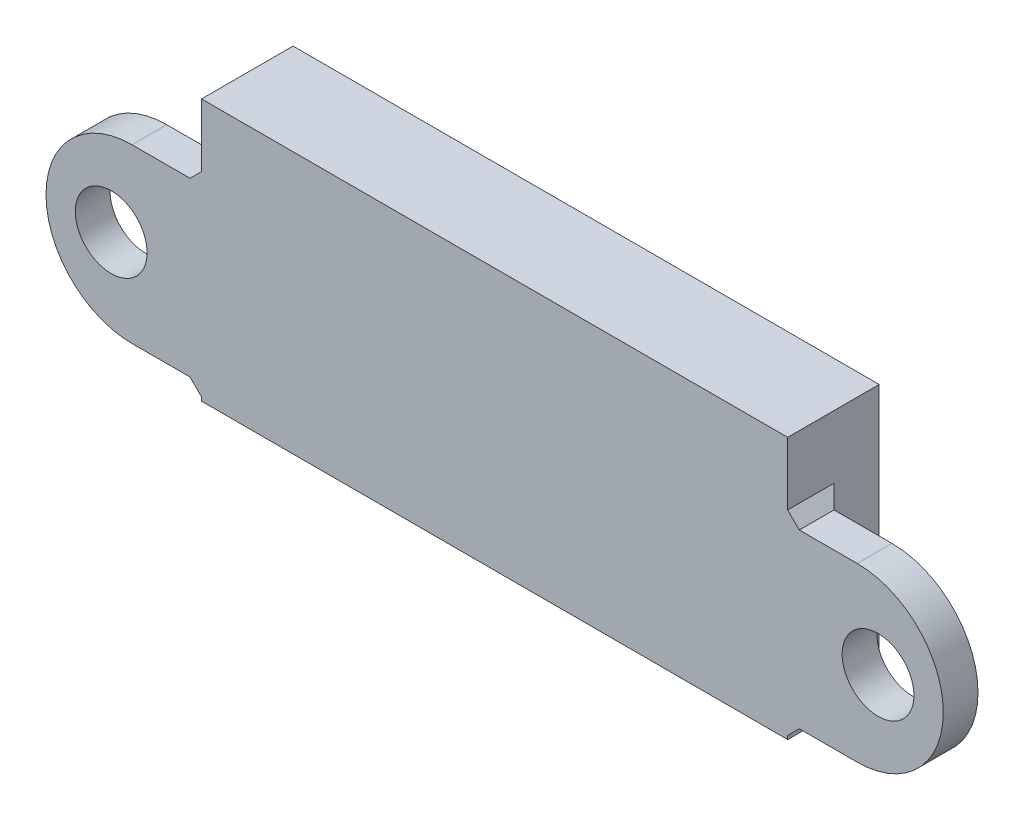
ISO-10303-21;
HEADER;
FILE_DESCRIPTION(('STEP AP214'),'2;1');
FILE_NAME('part.step','',(''),(''),'','','');
FILE_SCHEMA(('AUTOMOTIVE_DESIGN { 1 0 10303 214 1 1 1 1 }'));
ENDSEC;
DATA;
#1=APPLICATION_CONTEXT('core data for automotive mechanical design processes');
#2=APPLICATION_PROTOCOL_DEFINITION('international standard','automotive_design',2000,#1);
#3=PRODUCT_CONTEXT('',#1,'mechanical');
#4=PRODUCT('Part','Part','',(#3));
#5=PRODUCT_RELATED_PRODUCT_CATEGORY('part','',(#4));
#6=PRODUCT_DEFINITION_FORMATION('','',#4);
#7=PRODUCT_DEFINITION_CONTEXT('part definition',#1,'design');
#8=PRODUCT_DEFINITION('design','',#6,#7);
#9=PRODUCT_DEFINITION_SHAPE('','',#8);
#10=(LENGTH_UNIT() NAMED_UNIT(*) SI_UNIT(.MILLI.,.METRE.));
#11=(NAMED_UNIT(*) PLANE_ANGLE_UNIT() SI_UNIT($,.RADIAN.));
#12=(NAMED_UNIT(*) SI_UNIT($,.STERADIAN.) SOLID_ANGLE_UNIT());
#13=UNCERTAINTY_MEASURE_WITH_UNIT(LENGTH_MEASURE(1.E-05),#10,'distance_accuracy_value','');
#14=(GEOMETRIC_REPRESENTATION_CONTEXT(3) GLOBAL_UNCERTAINTY_ASSIGNED_CONTEXT((#13)) GLOBAL_UNIT_ASSIGNED_CONTEXT((#10,
#11,#12)) REPRESENTATION_CONTEXT('',''));
#15=CARTESIAN_POINT('',(0.,0.,0.));
#16=DIRECTION('',(0.,0.,1.));
#17=DIRECTION('',(1.,0.,0.));
#18=AXIS2_PLACEMENT_3D('',#15,#16,#17);
#19=CARTESIAN_POINT('',(0.,0.,5.));
#20=DIRECTION('',(0.,0.,1.));
#21=DIRECTION('',(1.,0.,0.));
#22=AXIS2_PLACEMENT_3D('',#19,#20,#21);
#23=PLANE('',#22);
#24=CARTESIAN_POINT('',(-33.1000000000001,-0.00956202959342609,5.));
#25=DIRECTION('',(0.,0.,-1.));
#26=DIRECTION('',(-1.,0.,0.));
#27=AXIS2_PLACEMENT_3D('',#24,#25,#26);
#28=CIRCLE('',#27,3.09999999999999);
#29=CARTESIAN_POINT('',(-36.2000000000001,-0.00956202959342609,5.));
#30=VERTEX_POINT('',#29);
#31=EDGE_CURVE('E342',#30,#30,#28,.T.);
#32=ORIENTED_EDGE('',*,*,#31,.T.);
#33=EDGE_LOOP('',(#32));
#34=FACE_BOUND('',#33,.T.);
#35=CARTESIAN_POINT('',(33.1000000000001,-0.00956202959342609,5.));
#36=DIRECTION('',(0.,0.,-1.));
#37=DIRECTION('',(1.,0.,0.));
#38=AXIS2_PLACEMENT_3D('',#35,#36,#37);
#39=CIRCLE('',#38,3.1);
#40=CARTESIAN_POINT('',(36.2000000000001,-0.00956202959342609,5.));
#41=VERTEX_POINT('',#40);
#42=EDGE_CURVE('E354',#41,#41,#39,.T.);
#43=ORIENTED_EDGE('',*,*,#42,.T.);
#44=EDGE_LOOP('',(#43));
#45=FACE_BOUND('',#44,.T.);
#46=DIRECTION('',(1.,0.,0.));
#47=VECTOR('',#46,1.);
#48=CARTESIAN_POINT('',(-25.3,-8.74999999999997,5.));
#49=LINE('',#48,#47);
#50=CARTESIAN_POINT('',(-25.3,-8.74999999999997,5.));
#51=VERTEX_POINT('',#50);
#52=CARTESIAN_POINT('',(25.3,-8.74999999999997,5.));
#53=VERTEX_POINT('',#52);
#54=EDGE_CURVE('E262',#51,#53,#49,.T.);
#55=ORIENTED_EDGE('',*,*,#54,.T.);
#56=DIRECTION('',(0.,1.,0.));
#57=VECTOR('',#56,1.);
#58=CARTESIAN_POINT('',(25.3,-8.74999999999997,5.));
#59=LINE('',#58,#57);
#60=CARTESIAN_POINT('',(25.3,-8.43955917908582,5.));
#61=VERTEX_POINT('',#60);
#62=EDGE_CURVE('E274',#53,#61,#59,.T.);
#63=ORIENTED_EDGE('',*,*,#62,.T.);
#64=DIRECTION('',(-0.707106781186543,-0.707106781186552,0.));
#65=VECTOR('',#64,1.);
#66=CARTESIAN_POINT('',(25.3,-8.43955917908582,5.));
#67=LINE('',#66,#65);
#68=CARTESIAN_POINT('',(26.3,-7.43955917908582,5.));
#69=VERTEX_POINT('',#68);
#70=EDGE_CURVE('E333',#61,#69,#67,.F.);
#71=ORIENTED_EDGE('',*,*,#70,.T.);
#72=DIRECTION('',(1.,0.,0.));
#73=VECTOR('',#72,1.);
#74=CARTESIAN_POINT('',(25.3,-7.43955917908582,5.));
#75=LINE('',#74,#73);
#76=CARTESIAN_POINT('',(31.3,-7.43955917908582,5.));
#77=VERTEX_POINT('',#76);
#78=EDGE_CURVE('E205',#69,#77,#75,.T.);
#79=ORIENTED_EDGE('',*,*,#78,.T.);
#80=CARTESIAN_POINT('',(31.3,-0.00956202959342609,5.));
#81=DIRECTION('',(0.,0.,1.));
#82=DIRECTION('',(1.,0.,0.));
#83=AXIS2_PLACEMENT_3D('',#80,#81,#82);
#84=CIRCLE('',#83,7.42999714949239);
#85=CARTESIAN_POINT('',(31.3,7.42043511989897,5.));
#86=VERTEX_POINT('',#85);
#87=EDGE_CURVE('E218',#77,#86,#84,.T.);
#88=ORIENTED_EDGE('',*,*,#87,.T.);
#89=DIRECTION('',(-1.,0.,0.));
#90=VECTOR('',#89,1.);
#91=CARTESIAN_POINT('',(31.3,7.42043511989897,5.));
#92=LINE('',#91,#90);
#93=CARTESIAN_POINT('',(26.3,7.42043511989897,5.));
#94=VERTEX_POINT('',#93);
#95=EDGE_CURVE('E210',#86,#94,#92,.T.);
#96=ORIENTED_EDGE('',*,*,#95,.T.);
#97=DIRECTION('',(0.707106781186542,-0.707106781186553,0.));
#98=VECTOR('',#97,1.);
#99=CARTESIAN_POINT('',(26.3,7.42043511989897,5.));
#100=LINE('',#99,#98);
#101=CARTESIAN_POINT('',(25.3,8.42043511989897,5.));
#102=VERTEX_POINT('',#101);
#103=EDGE_CURVE('E331',#94,#102,#100,.F.);
#104=ORIENTED_EDGE('',*,*,#103,.T.);
#105=CARTESIAN_POINT('',(25.3,13.85,5.));
#106=VERTEX_POINT('',#105);
#107=EDGE_CURVE('E273',#102,#106,#59,.T.);
#108=ORIENTED_EDGE('',*,*,#107,.T.);
#109=DIRECTION('',(-1.,0.,0.));
#110=VECTOR('',#109,1.);
#111=CARTESIAN_POINT('',(25.3,13.85,5.));
#112=LINE('',#111,#110);
#113=CARTESIAN_POINT('',(-25.3,13.85,5.));
#114=VERTEX_POINT('',#113);
#115=EDGE_CURVE('E277',#106,#114,#112,.T.);
#116=ORIENTED_EDGE('',*,*,#115,.T.);
#117=DIRECTION('',(0.,-1.,0.));
#118=VECTOR('',#117,1.);
#119=CARTESIAN_POINT('',(-25.3,13.85,5.));
#120=LINE('',#119,#118);
#121=CARTESIAN_POINT('',(-25.3,8.42043511989898,5.));
#122=VERTEX_POINT('',#121);
#123=EDGE_CURVE('E281',#114,#122,#120,.T.);
#124=ORIENTED_EDGE('',*,*,#123,.T.);
#125=DIRECTION('',(0.70710678118655,0.707106781186545,0.));
#126=VECTOR('',#125,1.);
#127=CARTESIAN_POINT('',(-25.3,8.42043511989898,5.));
#128=LINE('',#127,#126);
#129=CARTESIAN_POINT('',(-26.3,7.42043511989897,5.));
#130=VERTEX_POINT('',#129);
#131=EDGE_CURVE('E46',#122,#130,#128,.F.);
#132=ORIENTED_EDGE('',*,*,#131,.T.);
#133=DIRECTION('',(-1.,0.,0.));
#134=VECTOR('',#133,1.);
#135=CARTESIAN_POINT('',(-31.3000000000001,7.42043511989897,5.));
#136=LINE('',#135,#134);
#137=CARTESIAN_POINT('',(-31.3000000000001,7.42043511989897,5.));
#138=VERTEX_POINT('',#137);
#139=EDGE_CURVE('E193',#130,#138,#136,.T.);
#140=ORIENTED_EDGE('',*,*,#139,.T.);
#141=CARTESIAN_POINT('',(-31.3000000000001,-0.00956202959342609,5.));
#142=DIRECTION('',(0.,0.,1.));
#143=DIRECTION('',(-1.,0.,0.));
#144=AXIS2_PLACEMENT_3D('',#141,#142,#143);
#145=CIRCLE('',#144,7.42999714949239);
#146=CARTESIAN_POINT('',(-31.3,-7.43955917908582,5.));
#147=VERTEX_POINT('',#146);
#148=EDGE_CURVE('E201',#138,#147,#145,.T.);
#149=ORIENTED_EDGE('',*,*,#148,.T.);
#150=DIRECTION('',(1.,0.,0.));
#151=VECTOR('',#150,1.);
#152=CARTESIAN_POINT('',(-25.3,-7.43955917908582,5.));
#153=LINE('',#152,#151);
#154=CARTESIAN_POINT('',(-26.3,-7.43955917908582,5.));
#155=VERTEX_POINT('',#154);
#156=EDGE_CURVE('E178',#147,#155,#153,.T.);
#157=ORIENTED_EDGE('',*,*,#156,.T.);
#158=DIRECTION('',(-0.707106781186549,0.707106781186546,0.));
#159=VECTOR('',#158,1.);
#160=CARTESIAN_POINT('',(-26.3,-7.43955917908582,5.));
#161=LINE('',#160,#159);
#162=CARTESIAN_POINT('',(-25.3,-8.43955917908584,5.));
#163=VERTEX_POINT('',#162);
#164=EDGE_CURVE('E13',#155,#163,#161,.F.);
#165=ORIENTED_EDGE('',*,*,#164,.T.);
#166=EDGE_CURVE('E280',#163,#51,#120,.T.);
#167=ORIENTED_EDGE('',*,*,#166,.T.);
#168=EDGE_LOOP('',(#55,#63,#71,#79,#88,#96,#104,#108,#116,#124,#132,#140,#149,#157,#165,#167));
#169=FACE_BOUND('',#168,.T.);
#170=ADVANCED_FACE('F37',(#34,#45,#169),#23,.T.);
#171=CARTESIAN_POINT('',(24.,-7.44999999999997,-58.4176867074042));
#172=DIRECTION('',(1.,0.,0.));
#173=DIRECTION('',(0.,0.,-1.));
#174=AXIS2_PLACEMENT_3D('',#171,#172,#173);
#175=PLANE('',#174);
#176=DIRECTION('',(0.,0.,1.));
#177=VECTOR('',#176,1.);
#178=CARTESIAN_POINT('',(24.,-7.44999999999997,-58.4176867074042));
#179=LINE('',#178,#177);
#180=CARTESIAN_POINT('',(24.,-7.44999999999997,-2.9));
#181=VERTEX_POINT('',#180);
#182=CARTESIAN_POINT('',(24.,-7.44999999999997,0.));
#183=VERTEX_POINT('',#182);
#184=EDGE_CURVE('E235',#181,#183,#179,.T.);
#185=ORIENTED_EDGE('',*,*,#184,.T.);
#186=DIRECTION('',(0.,1.,0.));
#187=VECTOR('',#186,1.);
#188=CARTESIAN_POINT('',(24.,-7.44999999999997,0.));
#189=LINE('',#188,#187);
#190=CARTESIAN_POINT('',(24.,12.55,0.));
#191=VERTEX_POINT('',#190);
#192=EDGE_CURVE('E252',#183,#191,#189,.T.);
#193=ORIENTED_EDGE('',*,*,#192,.T.);
#194=DIRECTION('',(0.,0.,1.));
#195=VECTOR('',#194,1.);
#196=CARTESIAN_POINT('',(24.,12.55,-58.4176867074042));
#197=LINE('',#196,#195);
#198=CARTESIAN_POINT('',(24.,12.55,-2.9));
#199=VERTEX_POINT('',#198);
#200=EDGE_CURVE('E266',#199,#191,#197,.T.);
#201=ORIENTED_EDGE('',*,*,#200,.F.);
#202=DIRECTION('',(0.,-1.,0.));
#203=VECTOR('',#202,1.);
#204=CARTESIAN_POINT('',(24.,-7.44999999999997,-2.9));
#205=LINE('',#204,#203);
#206=EDGE_CURVE('E256',#199,#181,#205,.T.);
#207=ORIENTED_EDGE('',*,*,#206,.T.);
#208=EDGE_LOOP('',(#185,#193,#201,#207));
#209=FACE_BOUND('',#208,.T.);
#210=ADVANCED_FACE('F406',(#209),#175,.F.);
#211=CARTESIAN_POINT('',(24.,12.55,-58.4176867074042));
#212=DIRECTION('',(0.,1.,0.));
#213=DIRECTION('',(-1.,0.,0.));
#214=AXIS2_PLACEMENT_3D('',#211,#212,#213);
#215=PLANE('',#214);
#216=ORIENTED_EDGE('',*,*,#200,.T.);
#217=DIRECTION('',(-1.,0.,0.));
#218=VECTOR('',#217,1.);
#219=CARTESIAN_POINT('',(-6.08000000000001,12.55,0.));
#220=LINE('',#219,#218);
#221=CARTESIAN_POINT('',(-24.,12.55,0.));
#222=VERTEX_POINT('',#221);
#223=EDGE_CURVE('E298',#191,#222,#220,.T.);
#224=ORIENTED_EDGE('',*,*,#223,.T.);
#225=DIRECTION('',(0.,0.,1.));
#226=VECTOR('',#225,1.);
#227=CARTESIAN_POINT('',(-24.,12.55,-58.4176867074042));
#228=LINE('',#227,#226);
#229=CARTESIAN_POINT('',(-24.,12.55,-2.9));
#230=VERTEX_POINT('',#229);
#231=EDGE_CURVE('E263',#230,#222,#228,.T.);
#232=ORIENTED_EDGE('',*,*,#231,.F.);
#233=DIRECTION('',(1.,0.,0.));
#234=VECTOR('',#233,1.);
#235=CARTESIAN_POINT('',(24.,12.55,-2.9));
#236=LINE('',#235,#234);
#237=EDGE_CURVE('E240',#230,#199,#236,.T.);
#238=ORIENTED_EDGE('',*,*,#237,.T.);
#239=EDGE_LOOP('',(#216,#224,#232,#238));
#240=FACE_BOUND('',#239,.T.);
#241=ADVANCED_FACE('F411',(#240),#215,.F.);
#242=CARTESIAN_POINT('',(-24.,12.55,-58.4176867074042));
#243=DIRECTION('',(-1.,0.,0.));
#244=DIRECTION('',(0.,-1.,0.));
#245=AXIS2_PLACEMENT_3D('',#242,#243,#244);
#246=PLANE('',#245);
#247=ORIENTED_EDGE('',*,*,#231,.T.);
#248=DIRECTION('',(0.,-1.,0.));
#249=VECTOR('',#248,1.);
#250=CARTESIAN_POINT('',(-24.,12.55,0.));
#251=LINE('',#250,#249);
#252=CARTESIAN_POINT('',(-24.,-7.44999999999997,0.));
#253=VERTEX_POINT('',#252);
#254=EDGE_CURVE('E301',#222,#253,#251,.T.);
#255=ORIENTED_EDGE('',*,*,#254,.T.);
#256=DIRECTION('',(0.,0.,1.));
#257=VECTOR('',#256,1.);
#258=CARTESIAN_POINT('',(-24.,-7.44999999999997,-58.4176867074042));
#259=LINE('',#258,#257);
#260=CARTESIAN_POINT('',(-24.,-7.44999999999997,-2.9));
#261=VERTEX_POINT('',#260);
#262=EDGE_CURVE('E259',#261,#253,#259,.T.);
#263=ORIENTED_EDGE('',*,*,#262,.F.);
#264=DIRECTION('',(0.,1.,0.));
#265=VECTOR('',#264,1.);
#266=CARTESIAN_POINT('',(-24.,12.55,-2.9));
#267=LINE('',#266,#265);
#268=EDGE_CURVE('E244',#261,#230,#267,.T.);
#269=ORIENTED_EDGE('',*,*,#268,.T.);
#270=EDGE_LOOP('',(#247,#255,#263,#269));
#271=FACE_BOUND('',#270,.T.);
#272=ADVANCED_FACE('F500',(#271),#246,.F.);
#273=CARTESIAN_POINT('',(-24.,-7.44999999999997,-58.4176867074042));
#274=DIRECTION('',(0.,-1.,0.));
#275=DIRECTION('',(0.,0.,-1.));
#276=AXIS2_PLACEMENT_3D('',#273,#274,#275);
#277=PLANE('',#276);
#278=ORIENTED_EDGE('',*,*,#262,.T.);
#279=DIRECTION('',(1.,0.,0.));
#280=VECTOR('',#279,1.);
#281=CARTESIAN_POINT('',(-24.,-7.44999999999997,0.));
#282=LINE('',#281,#280);
#283=EDGE_CURVE('E304',#253,#183,#282,.T.);
#284=ORIENTED_EDGE('',*,*,#283,.T.);
#285=ORIENTED_EDGE('',*,*,#184,.F.);
#286=DIRECTION('',(-1.,0.,0.));
#287=VECTOR('',#286,1.);
#288=CARTESIAN_POINT('',(-24.,-7.44999999999997,-2.9));
#289=LINE('',#288,#287);
#290=EDGE_CURVE('E247',#181,#261,#289,.T.);
#291=ORIENTED_EDGE('',*,*,#290,.T.);
#292=EDGE_LOOP('',(#278,#284,#285,#291));
#293=FACE_BOUND('',#292,.T.);
#294=ADVANCED_FACE('F503',(#293),#277,.F.);
#295=CARTESIAN_POINT('',(25.3,-8.74999999999997,-58.4176867074042));
#296=DIRECTION('',(1.,0.,0.));
#297=DIRECTION('',(0.,0.,-1.));
#298=AXIS2_PLACEMENT_3D('',#295,#296,#297);
#299=PLANE('',#298);
#300=ORIENTED_EDGE('',*,*,#107,.F.);
#301=DIRECTION('',(0.,0.,-1.));
#302=VECTOR('',#301,1.);
#303=CARTESIAN_POINT('',(25.3,8.42043511989897,2.));
#304=LINE('',#303,#302);
#305=CARTESIAN_POINT('',(25.3,8.42043511989897,1.));
#306=VERTEX_POINT('',#305);
#307=EDGE_CURVE('E314',#102,#306,#304,.T.);
#308=ORIENTED_EDGE('',*,*,#307,.T.);
#309=DIRECTION('',(0.,-1.,0.));
#310=VECTOR('',#309,1.);
#311=CARTESIAN_POINT('',(25.3,-8.74999999999997,1.));
#312=LINE('',#311,#310);
#313=CARTESIAN_POINT('',(25.3,-8.43955917908582,1.));
#314=VERTEX_POINT('',#313);
#315=EDGE_CURVE('E312',#306,#314,#312,.T.);
#316=ORIENTED_EDGE('',*,*,#315,.T.);
#317=DIRECTION('',(0.,0.,1.));
#318=VECTOR('',#317,1.);
#319=CARTESIAN_POINT('',(25.3,-8.43955917908582,5.));
#320=LINE('',#319,#318);
#321=EDGE_CURVE('E310',#314,#61,#320,.T.);
#322=ORIENTED_EDGE('',*,*,#321,.T.);
#323=ORIENTED_EDGE('',*,*,#62,.F.);
#324=DIRECTION('',(0.,0.,1.));
#325=VECTOR('',#324,1.);
#326=CARTESIAN_POINT('',(25.3,-8.74999999999997,-58.4176867074042));
#327=LINE('',#326,#325);
#328=CARTESIAN_POINT('',(25.3,-8.74999999999997,-2.9));
#329=VERTEX_POINT('',#328);
#330=EDGE_CURVE('E284',#329,#53,#327,.T.);
#331=ORIENTED_EDGE('',*,*,#330,.F.);
#332=DIRECTION('',(0.,-1.,0.));
#333=VECTOR('',#332,1.);
#334=CARTESIAN_POINT('',(25.3,-8.74999999999997,-2.9));
#335=LINE('',#334,#333);
#336=CARTESIAN_POINT('',(25.3,13.85,-2.9));
#337=VERTEX_POINT('',#336);
#338=EDGE_CURVE('E243',#337,#329,#335,.T.);
#339=ORIENTED_EDGE('',*,*,#338,.F.);
#340=DIRECTION('',(0.,0.,1.));
#341=VECTOR('',#340,1.);
#342=CARTESIAN_POINT('',(25.3,13.85,-58.4176867074042));
#343=LINE('',#342,#341);
#344=EDGE_CURVE('E290',#337,#106,#343,.T.);
#345=ORIENTED_EDGE('',*,*,#344,.T.);
#346=EDGE_LOOP('',(#300,#308,#316,#322,#323,#331,#339,#345));
#347=FACE_BOUND('',#346,.T.);
#348=ADVANCED_FACE('F456',(#347),#299,.T.);
#349=CARTESIAN_POINT('',(25.3,13.85,-58.4176867074042));
#350=DIRECTION('',(0.,1.,0.));
#351=DIRECTION('',(0.,0.,1.));
#352=AXIS2_PLACEMENT_3D('',#349,#350,#351);
#353=PLANE('',#352);
#354=DIRECTION('',(1.,0.,0.));
#355=VECTOR('',#354,1.);
#356=CARTESIAN_POINT('',(25.3,13.85,-2.9));
#357=LINE('',#356,#355);
#358=CARTESIAN_POINT('',(-25.3,13.85,-2.9));
#359=VERTEX_POINT('',#358);
#360=EDGE_CURVE('E253',#359,#337,#357,.T.);
#361=ORIENTED_EDGE('',*,*,#360,.F.);
#362=DIRECTION('',(0.,0.,1.));
#363=VECTOR('',#362,1.);
#364=CARTESIAN_POINT('',(-25.3,13.85,-58.4176867074042));
#365=LINE('',#364,#363);
#366=EDGE_CURVE('E288',#359,#114,#365,.T.);
#367=ORIENTED_EDGE('',*,*,#366,.T.);
#368=ORIENTED_EDGE('',*,*,#115,.F.);
#369=ORIENTED_EDGE('',*,*,#344,.F.);
#370=EDGE_LOOP('',(#361,#367,#368,#369));
#371=FACE_BOUND('',#370,.T.);
#372=ADVANCED_FACE('F513',(#371),#353,.T.);
#373=CARTESIAN_POINT('',(-25.3,13.85,-58.4176867074042));
#374=DIRECTION('',(-1.,0.,0.));
#375=DIRECTION('',(0.,0.,1.));
#376=AXIS2_PLACEMENT_3D('',#373,#374,#375);
#377=PLANE('',#376);
#378=DIRECTION('',(0.,1.,0.));
#379=VECTOR('',#378,1.);
#380=CARTESIAN_POINT('',(-25.3,7.42043511989897,0.999999999999987));
#381=LINE('',#380,#379);
#382=CARTESIAN_POINT('',(-25.3,-8.43955917908584,0.999999999999987));
#383=VERTEX_POINT('',#382);
#384=CARTESIAN_POINT('',(-25.3,8.42043511989898,0.999999999999987));
#385=VERTEX_POINT('',#384);
#386=EDGE_CURVE('E322',#383,#385,#381,.T.);
#387=ORIENTED_EDGE('',*,*,#386,.T.);
#388=DIRECTION('',(0.,0.,1.));
#389=VECTOR('',#388,1.);
#390=CARTESIAN_POINT('',(-25.3,8.42043511989898,5.));
#391=LINE('',#390,#389);
#392=EDGE_CURVE('E324',#385,#122,#391,.T.);
#393=ORIENTED_EDGE('',*,*,#392,.T.);
#394=ORIENTED_EDGE('',*,*,#123,.F.);
#395=ORIENTED_EDGE('',*,*,#366,.F.);
#396=DIRECTION('',(0.,1.,0.));
#397=VECTOR('',#396,1.);
#398=CARTESIAN_POINT('',(-25.3,13.85,-2.9));
#399=LINE('',#398,#397);
#400=CARTESIAN_POINT('',(-25.3,-8.74999999999997,-2.9));
#401=VERTEX_POINT('',#400);
#402=EDGE_CURVE('E255',#401,#359,#399,.T.);
#403=ORIENTED_EDGE('',*,*,#402,.F.);
#404=DIRECTION('',(0.,0.,1.));
#405=VECTOR('',#404,1.);
#406=CARTESIAN_POINT('',(-25.3,-8.74999999999997,-58.4176867074042));
#407=LINE('',#406,#405);
#408=EDGE_CURVE('E285',#401,#51,#407,.T.);
#409=ORIENTED_EDGE('',*,*,#408,.T.);
#410=ORIENTED_EDGE('',*,*,#166,.F.);
#411=DIRECTION('',(0.,0.,-1.));
#412=VECTOR('',#411,1.);
#413=CARTESIAN_POINT('',(-25.3,-8.43955917908584,2.));
#414=LINE('',#413,#412);
#415=EDGE_CURVE('E320',#163,#383,#414,.T.);
#416=ORIENTED_EDGE('',*,*,#415,.T.);
#417=EDGE_LOOP('',(#387,#393,#394,#395,#403,#409,#410,#416));
#418=FACE_BOUND('',#417,.T.);
#419=ADVANCED_FACE('F446',(#418),#377,.T.);
#420=CARTESIAN_POINT('',(-25.3,-8.74999999999997,-58.4176867074042));
#421=DIRECTION('',(0.,-1.,0.));
#422=DIRECTION('',(0.,0.,-1.));
#423=AXIS2_PLACEMENT_3D('',#420,#421,#422);
#424=PLANE('',#423);
#425=DIRECTION('',(-1.,0.,0.));
#426=VECTOR('',#425,1.);
#427=CARTESIAN_POINT('',(-25.3,-8.74999999999997,-2.9));
#428=LINE('',#427,#426);
#429=EDGE_CURVE('E250',#329,#401,#428,.T.);
#430=ORIENTED_EDGE('',*,*,#429,.F.);
#431=ORIENTED_EDGE('',*,*,#330,.T.);
#432=ORIENTED_EDGE('',*,*,#54,.F.);
#433=ORIENTED_EDGE('',*,*,#408,.F.);
#434=EDGE_LOOP('',(#430,#431,#432,#433));
#435=FACE_BOUND('',#434,.T.);
#436=ADVANCED_FACE('F416',(#435),#424,.T.);
#437=CARTESIAN_POINT('',(0.,5.5,-2.9));
#438=DIRECTION('',(0.,0.,1.));
#439=DIRECTION('',(0.,1.,0.));
#440=AXIS2_PLACEMENT_3D('',#437,#438,#439);
#441=PLANE('',#440);
#442=ORIENTED_EDGE('',*,*,#429,.T.);
#443=ORIENTED_EDGE('',*,*,#402,.T.);
#444=ORIENTED_EDGE('',*,*,#360,.T.);
#445=ORIENTED_EDGE('',*,*,#338,.T.);
#446=EDGE_LOOP('',(#442,#443,#444,#445));
#447=FACE_BOUND('',#446,.T.);
#448=ORIENTED_EDGE('',*,*,#206,.F.);
#449=ORIENTED_EDGE('',*,*,#237,.F.);
#450=ORIENTED_EDGE('',*,*,#268,.F.);
#451=ORIENTED_EDGE('',*,*,#290,.F.);
#452=EDGE_LOOP('',(#448,#449,#450,#451));
#453=FACE_BOUND('',#452,.T.);
#454=ADVANCED_FACE('F422',(#447,#453),#441,.F.);
#455=CARTESIAN_POINT('',(0.,0.,0.));
#456=DIRECTION('',(0.,0.,1.));
#457=DIRECTION('',(1.,0.,0.));
#458=AXIS2_PLACEMENT_3D('',#455,#456,#457);
#459=PLANE('',#458);
#460=CARTESIAN_POINT('',(18.5,0.,0.));
#461=DIRECTION('',(0.,0.,-1.));
#462=DIRECTION('',(-1.,0.,0.));
#463=AXIS2_PLACEMENT_3D('',#460,#461,#462);
#464=CIRCLE('',#463,1.1);
#465=CARTESIAN_POINT('',(17.4,0.,0.));
#466=VERTEX_POINT('',#465);
#467=EDGE_CURVE('E228',#466,#466,#464,.T.);
#468=ORIENTED_EDGE('',*,*,#467,.F.);
#469=EDGE_LOOP('',(#468));
#470=FACE_BOUND('',#469,.T.);
#471=CARTESIAN_POINT('',(-18.5,0.,0.));
#472=DIRECTION('',(0.,0.,-1.));
#473=DIRECTION('',(-1.,0.,0.));
#474=AXIS2_PLACEMENT_3D('',#471,#472,#473);
#475=CIRCLE('',#474,1.1);
#476=CARTESIAN_POINT('',(-19.6,0.,0.));
#477=VERTEX_POINT('',#476);
#478=EDGE_CURVE('E225',#477,#477,#475,.T.);
#479=ORIENTED_EDGE('',*,*,#478,.F.);
#480=EDGE_LOOP('',(#479));
#481=FACE_BOUND('',#480,.T.);
#482=ORIENTED_EDGE('',*,*,#192,.F.);
#483=ORIENTED_EDGE('',*,*,#283,.F.);
#484=ORIENTED_EDGE('',*,*,#254,.F.);
#485=ORIENTED_EDGE('',*,*,#223,.F.);
#486=EDGE_LOOP('',(#482,#483,#484,#485));
#487=FACE_BOUND('',#486,.T.);
#488=ADVANCED_FACE('F418',(#470,#481,#487),#459,.F.);
#489=CARTESIAN_POINT('',(0.,0.,3.));
#490=DIRECTION('',(0.,0.,1.));
#491=DIRECTION('',(1.,0.,0.));
#492=AXIS2_PLACEMENT_3D('',#489,#490,#491);
#493=PLANE('',#492);
#494=CARTESIAN_POINT('',(-18.5,0.,3.));
#495=DIRECTION('',(0.,0.,1.));
#496=DIRECTION('',(1.,0.,0.));
#497=AXIS2_PLACEMENT_3D('',#494,#495,#496);
#498=CIRCLE('',#497,1.1);
#499=CARTESIAN_POINT('',(-17.4,0.,3.));
#500=VERTEX_POINT('',#499);
#501=EDGE_CURVE('E232',#500,#500,#498,.F.);
#502=ORIENTED_EDGE('',*,*,#501,.T.);
#503=EDGE_LOOP('',(#502));
#504=FACE_BOUND('',#503,.T.);
#505=ADVANCED_FACE('F421',(#504),#493,.F.);
#506=CARTESIAN_POINT('',(-18.5,0.,8.11126983722081));
#507=DIRECTION('',(0.,0.,-1.));
#508=DIRECTION('',(-1.,0.,0.));
#509=AXIS2_PLACEMENT_3D('',#506,#507,#508);
#510=CYLINDRICAL_SURFACE('',#509,1.1);
#511=ORIENTED_EDGE('',*,*,#478,.T.);
#512=EDGE_LOOP('',(#511));
#513=FACE_BOUND('',#512,.T.);
#514=ORIENTED_EDGE('',*,*,#501,.F.);
#515=EDGE_LOOP('',(#514));
#516=FACE_BOUND('',#515,.T.);
#517=ADVANCED_FACE('F486',(#513,#516),#510,.F.);
#518=CARTESIAN_POINT('',(0.,0.,3.));
#519=DIRECTION('',(0.,0.,1.));
#520=DIRECTION('',(1.,0.,0.));
#521=AXIS2_PLACEMENT_3D('',#518,#519,#520);
#522=PLANE('',#521);
#523=CARTESIAN_POINT('',(18.5,0.,3.));
#524=DIRECTION('',(0.,0.,1.));
#525=DIRECTION('',(1.,0.,0.));
#526=AXIS2_PLACEMENT_3D('',#523,#524,#525);
#527=CIRCLE('',#526,1.1);
#528=CARTESIAN_POINT('',(19.6,0.,3.));
#529=VERTEX_POINT('',#528);
#530=EDGE_CURVE('E231',#529,#529,#527,.F.);
#531=ORIENTED_EDGE('',*,*,#530,.T.);
#532=EDGE_LOOP('',(#531));
#533=FACE_BOUND('',#532,.T.);
#534=ADVANCED_FACE('F481',(#533),#522,.F.);
#535=CARTESIAN_POINT('',(18.5,0.,8.11126983722081));
#536=DIRECTION('',(0.,0.,-1.));
#537=DIRECTION('',(-1.,0.,0.));
#538=AXIS2_PLACEMENT_3D('',#535,#536,#537);
#539=CYLINDRICAL_SURFACE('',#538,1.1);
#540=ORIENTED_EDGE('',*,*,#467,.T.);
#541=EDGE_LOOP('',(#540));
#542=FACE_BOUND('',#541,.T.);
#543=ORIENTED_EDGE('',*,*,#530,.F.);
#544=EDGE_LOOP('',(#543));
#545=FACE_BOUND('',#544,.T.);
#546=ADVANCED_FACE('F477',(#542,#545),#539,.F.);
#547=CARTESIAN_POINT('',(31.3,7.42043511989897,2.));
#548=DIRECTION('',(0.,1.,0.));
#549=DIRECTION('',(-1.,0.,0.));
#550=AXIS2_PLACEMENT_3D('',#547,#548,#549);
#551=PLANE('',#550);
#552=DIRECTION('',(-1.,0.,0.));
#553=VECTOR('',#552,1.);
#554=CARTESIAN_POINT('',(31.3,7.42043511989897,2.));
#555=LINE('',#554,#553);
#556=CARTESIAN_POINT('',(31.3,7.42043511989897,2.));
#557=VERTEX_POINT('',#556);
#558=CARTESIAN_POINT('',(26.3,7.42043511989897,2.));
#559=VERTEX_POINT('',#558);
#560=EDGE_CURVE('E213',#557,#559,#555,.T.);
#561=ORIENTED_EDGE('',*,*,#560,.T.);
#562=DIRECTION('',(0.,0.,1.));
#563=VECTOR('',#562,1.);
#564=CARTESIAN_POINT('',(26.3,7.42043511989897,5.));
#565=LINE('',#564,#563);
#566=EDGE_CURVE('E307',#559,#94,#565,.T.);
#567=ORIENTED_EDGE('',*,*,#566,.T.);
#568=ORIENTED_EDGE('',*,*,#95,.F.);
#569=DIRECTION('',(0.,0.,1.));
#570=VECTOR('',#569,1.);
#571=CARTESIAN_POINT('',(31.3,7.42043511989897,2.));
#572=LINE('',#571,#570);
#573=EDGE_CURVE('E223',#557,#86,#572,.T.);
#574=ORIENTED_EDGE('',*,*,#573,.F.);
#575=EDGE_LOOP('',(#561,#567,#568,#574));
#576=FACE_BOUND('',#575,.T.);
#577=ADVANCED_FACE('F391',(#576),#551,.T.);
#578=CARTESIAN_POINT('',(31.3,-0.00956202959342609,2.));
#579=DIRECTION('',(0.,0.,1.));
#580=DIRECTION('',(1.,0.,0.));
#581=AXIS2_PLACEMENT_3D('',#578,#579,#580);
#582=CYLINDRICAL_SURFACE('',#581,7.42999714949239);
#583=ORIENTED_EDGE('',*,*,#87,.F.);
#584=DIRECTION('',(0.,0.,1.));
#585=VECTOR('',#584,1.);
#586=CARTESIAN_POINT('',(31.3,-7.43955917908582,2.));
#587=LINE('',#586,#585);
#588=CARTESIAN_POINT('',(31.3,-7.43955917908582,2.));
#589=VERTEX_POINT('',#588);
#590=EDGE_CURVE('E216',#589,#77,#587,.T.);
#591=ORIENTED_EDGE('',*,*,#590,.F.);
#592=CARTESIAN_POINT('',(31.3,-0.00956202959342609,2.));
#593=DIRECTION('',(0.,0.,1.));
#594=DIRECTION('',(1.,0.,0.));
#595=AXIS2_PLACEMENT_3D('',#592,#593,#594);
#596=CIRCLE('',#595,7.42999714949239);
#597=EDGE_CURVE('E209',#589,#557,#596,.T.);
#598=ORIENTED_EDGE('',*,*,#597,.T.);
#599=ORIENTED_EDGE('',*,*,#573,.T.);
#600=EDGE_LOOP('',(#583,#591,#598,#599));
#601=FACE_BOUND('',#600,.T.);
#602=ADVANCED_FACE('F397',(#601),#582,.T.);
#603=CARTESIAN_POINT('',(25.3,-7.43955917908582,2.));
#604=DIRECTION('',(0.,-1.,0.));
#605=DIRECTION('',(1.,0.,0.));
#606=AXIS2_PLACEMENT_3D('',#603,#604,#605);
#607=PLANE('',#606);
#608=ORIENTED_EDGE('',*,*,#78,.F.);
#609=DIRECTION('',(0.,0.,-1.));
#610=VECTOR('',#609,1.);
#611=CARTESIAN_POINT('',(26.3,-7.43955917908582,2.));
#612=LINE('',#611,#610);
#613=CARTESIAN_POINT('',(26.3,-7.43955917908582,2.));
#614=VERTEX_POINT('',#613);
#615=EDGE_CURVE('E318',#69,#614,#612,.T.);
#616=ORIENTED_EDGE('',*,*,#615,.T.);
#617=DIRECTION('',(1.,0.,0.));
#618=VECTOR('',#617,1.);
#619=CARTESIAN_POINT('',(25.3,-7.43955917908582,2.));
#620=LINE('',#619,#618);
#621=EDGE_CURVE('E207',#614,#589,#620,.T.);
#622=ORIENTED_EDGE('',*,*,#621,.T.);
#623=ORIENTED_EDGE('',*,*,#590,.T.);
#624=EDGE_LOOP('',(#608,#616,#622,#623));
#625=FACE_BOUND('',#624,.T.);
#626=ADVANCED_FACE('F367',(#625),#607,.T.);
#627=CARTESIAN_POINT('',(31.3,-0.00956202959342609,2.));
#628=DIRECTION('',(0.,0.,1.));
#629=DIRECTION('',(1.,0.,0.));
#630=AXIS2_PLACEMENT_3D('',#627,#628,#629);
#631=PLANE('',#630);
#632=CARTESIAN_POINT('',(33.1000000000001,-0.00956202959342609,2.));
#633=DIRECTION('',(0.,0.,-1.));
#634=DIRECTION('',(1.,0.,0.));
#635=AXIS2_PLACEMENT_3D('',#632,#633,#634);
#636=CIRCLE('',#635,3.1);
#637=CARTESIAN_POINT('',(36.2000000000001,-0.00956202959342609,2.));
#638=VERTEX_POINT('',#637);
#639=EDGE_CURVE('E197',#638,#638,#636,.T.);
#640=ORIENTED_EDGE('',*,*,#639,.F.);
#641=EDGE_LOOP('',(#640));
#642=FACE_BOUND('',#641,.T.);
#643=ORIENTED_EDGE('',*,*,#621,.F.);
#644=DIRECTION('',(0.,1.,0.));
#645=VECTOR('',#644,1.);
#646=CARTESIAN_POINT('',(26.3,-0.00956202959342609,2.));
#647=LINE('',#646,#645);
#648=EDGE_CURVE('E316',#614,#559,#647,.T.);
#649=ORIENTED_EDGE('',*,*,#648,.T.);
#650=ORIENTED_EDGE('',*,*,#560,.F.);
#651=ORIENTED_EDGE('',*,*,#597,.F.);
#652=EDGE_LOOP('',(#643,#649,#650,#651));
#653=FACE_BOUND('',#652,.T.);
#654=ADVANCED_FACE('F364',(#642,#653),#631,.F.);
#655=CARTESIAN_POINT('',(-31.3000000000001,-0.00956202959342609,2.));
#656=DIRECTION('',(0.,0.,1.));
#657=DIRECTION('',(1.,0.,0.));
#658=AXIS2_PLACEMENT_3D('',#655,#656,#657);
#659=CYLINDRICAL_SURFACE('',#658,7.42999714949239);
#660=ORIENTED_EDGE('',*,*,#148,.F.);
#661=DIRECTION('',(0.,0.,1.));
#662=VECTOR('',#661,1.);
#663=CARTESIAN_POINT('',(-31.3000000000001,7.42043511989897,2.));
#664=LINE('',#663,#662);
#665=CARTESIAN_POINT('',(-31.3000000000001,7.42043511989897,2.));
#666=VERTEX_POINT('',#665);
#667=EDGE_CURVE('E183',#666,#138,#664,.T.);
#668=ORIENTED_EDGE('',*,*,#667,.F.);
#669=CARTESIAN_POINT('',(-31.3000000000001,-0.00956202959342609,2.));
#670=DIRECTION('',(0.,0.,1.));
#671=DIRECTION('',(-1.,0.,0.));
#672=AXIS2_PLACEMENT_3D('',#669,#670,#671);
#673=CIRCLE('',#672,7.42999714949239);
#674=CARTESIAN_POINT('',(-31.3,-7.43955917908582,2.));
#675=VERTEX_POINT('',#674);
#676=EDGE_CURVE('E188',#666,#675,#673,.T.);
#677=ORIENTED_EDGE('',*,*,#676,.T.);
#678=DIRECTION('',(0.,0.,1.));
#679=VECTOR('',#678,1.);
#680=CARTESIAN_POINT('',(-31.3,-7.43955917908582,2.));
#681=LINE('',#680,#679);
#682=EDGE_CURVE('E175',#675,#147,#681,.T.);
#683=ORIENTED_EDGE('',*,*,#682,.T.);
#684=EDGE_LOOP('',(#660,#668,#677,#683));
#685=FACE_BOUND('',#684,.T.);
#686=ADVANCED_FACE('F191',(#685),#659,.T.);
#687=CARTESIAN_POINT('',(-31.3000000000001,7.42043511989897,2.));
#688=DIRECTION('',(0.,1.,0.));
#689=DIRECTION('',(-1.,0.,0.));
#690=AXIS2_PLACEMENT_3D('',#687,#688,#689);
#691=PLANE('',#690);
#692=ORIENTED_EDGE('',*,*,#139,.F.);
#693=DIRECTION('',(0.,0.,-1.));
#694=VECTOR('',#693,1.);
#695=CARTESIAN_POINT('',(-26.3,7.42043511989897,2.));
#696=LINE('',#695,#694);
#697=CARTESIAN_POINT('',(-26.3,7.42043511989897,2.));
#698=VERTEX_POINT('',#697);
#699=EDGE_CURVE('E327',#130,#698,#696,.T.);
#700=ORIENTED_EDGE('',*,*,#699,.T.);
#701=DIRECTION('',(-1.,0.,0.));
#702=VECTOR('',#701,1.);
#703=CARTESIAN_POINT('',(-31.3000000000001,7.42043511989897,2.));
#704=LINE('',#703,#702);
#705=EDGE_CURVE('E184',#698,#666,#704,.T.);
#706=ORIENTED_EDGE('',*,*,#705,.T.);
#707=ORIENTED_EDGE('',*,*,#667,.T.);
#708=EDGE_LOOP('',(#692,#700,#706,#707));
#709=FACE_BOUND('',#708,.T.);
#710=ADVANCED_FACE('F464',(#709),#691,.T.);
#711=CARTESIAN_POINT('',(-25.3,-7.43955917908582,2.));
#712=DIRECTION('',(0.,-1.,0.));
#713=DIRECTION('',(1.,0.,0.));
#714=AXIS2_PLACEMENT_3D('',#711,#712,#713);
#715=PLANE('',#714);
#716=DIRECTION('',(1.,0.,0.));
#717=VECTOR('',#716,1.);
#718=CARTESIAN_POINT('',(-25.3,-7.43955917908582,2.));
#719=LINE('',#718,#717);
#720=CARTESIAN_POINT('',(-26.3,-7.43955917908582,2.));
#721=VERTEX_POINT('',#720);
#722=EDGE_CURVE('E177',#675,#721,#719,.T.);
#723=ORIENTED_EDGE('',*,*,#722,.T.);
#724=DIRECTION('',(0.,0.,1.));
#725=VECTOR('',#724,1.);
#726=CARTESIAN_POINT('',(-26.3,-7.43955917908582,5.));
#727=LINE('',#726,#725);
#728=EDGE_CURVE('E54',#721,#155,#727,.T.);
#729=ORIENTED_EDGE('',*,*,#728,.T.);
#730=ORIENTED_EDGE('',*,*,#156,.F.);
#731=ORIENTED_EDGE('',*,*,#682,.F.);
#732=EDGE_LOOP('',(#723,#729,#730,#731));
#733=FACE_BOUND('',#732,.T.);
#734=ADVANCED_FACE('F176',(#733),#715,.T.);
#735=CARTESIAN_POINT('',(-31.3000000000001,-0.00956202959342609,2.));
#736=DIRECTION('',(0.,0.,-1.));
#737=DIRECTION('',(-1.,0.,0.));
#738=AXIS2_PLACEMENT_3D('',#735,#736,#737);
#739=PLANE('',#738);
#740=CARTESIAN_POINT('',(-33.1000000000001,-0.00956202959342609,2.));
#741=DIRECTION('',(0.,0.,-1.));
#742=DIRECTION('',(-1.,0.,0.));
#743=AXIS2_PLACEMENT_3D('',#740,#741,#742);
#744=CIRCLE('',#743,3.09999999999999);
#745=CARTESIAN_POINT('',(-36.2000000000001,-0.00956202959342609,2.));
#746=VERTEX_POINT('',#745);
#747=EDGE_CURVE('E349',#746,#746,#744,.T.);
#748=ORIENTED_EDGE('',*,*,#747,.F.);
#749=EDGE_LOOP('',(#748));
#750=FACE_BOUND('',#749,.T.);
#751=ORIENTED_EDGE('',*,*,#705,.F.);
#752=DIRECTION('',(0.,-1.,0.));
#753=VECTOR('',#752,1.);
#754=CARTESIAN_POINT('',(-26.3,-7.43955917908582,2.));
#755=LINE('',#754,#753);
#756=EDGE_CURVE('E62',#698,#721,#755,.T.);
#757=ORIENTED_EDGE('',*,*,#756,.T.);
#758=ORIENTED_EDGE('',*,*,#722,.F.);
#759=ORIENTED_EDGE('',*,*,#676,.F.);
#760=EDGE_LOOP('',(#751,#757,#758,#759));
#761=FACE_BOUND('',#760,.T.);
#762=ADVANCED_FACE('F187',(#750,#761),#739,.T.);
#763=CARTESIAN_POINT('',(25.3,-8.43955917908582,-58.4176867074042));
#764=DIRECTION('',(0.707106781186552,-0.707106781186543,0.));
#765=DIRECTION('',(0.,0.,-1.));
#766=AXIS2_PLACEMENT_3D('',#763,#764,#765);
#767=PLANE('',#766);
#768=ORIENTED_EDGE('',*,*,#70,.F.);
#769=ORIENTED_EDGE('',*,*,#321,.F.);
#770=DIRECTION('',(-0.577350269189621,-0.577350269189629,-0.577350269189628));
#771=VECTOR('',#770,1.);
#772=CARTESIAN_POINT('',(5.49410443086536,-28.2454547482207,-18.8058955691349));
#773=LINE('',#772,#771);
#774=EDGE_CURVE('E203',#614,#314,#773,.T.);
#775=ORIENTED_EDGE('',*,*,#774,.F.);
#776=ORIENTED_EDGE('',*,*,#615,.F.);
#777=EDGE_LOOP('',(#768,#769,#775,#776));
#778=FACE_BOUND('',#777,.T.);
#779=ADVANCED_FACE('F380',(#778),#767,.T.);
#780=CARTESIAN_POINT('',(25.3,-8.74999999999997,1.));
#781=DIRECTION('',(-0.707106781186552,0.,0.707106781186543));
#782=DIRECTION('',(0.,-1.,0.));
#783=AXIS2_PLACEMENT_3D('',#780,#781,#782);
#784=PLANE('',#783);
#785=ORIENTED_EDGE('',*,*,#774,.T.);
#786=ORIENTED_EDGE('',*,*,#315,.F.);
#787=DIRECTION('',(-0.577350269189621,0.577350269189629,-0.577350269189628));
#788=VECTOR('',#787,1.);
#789=CARTESIAN_POINT('',(31.0234783732996,2.69695674659926,6.7234783732997));
#790=LINE('',#789,#788);
#791=EDGE_CURVE('E336',#559,#306,#790,.T.);
#792=ORIENTED_EDGE('',*,*,#791,.F.);
#793=ORIENTED_EDGE('',*,*,#648,.F.);
#794=EDGE_LOOP('',(#785,#786,#792,#793));
#795=FACE_BOUND('',#794,.T.);
#796=ADVANCED_FACE('F384',(#795),#784,.F.);
#797=CARTESIAN_POINT('',(26.3,7.42043511989897,2.));
#798=DIRECTION('',(0.707106781186553,0.707106781186542,0.));
#799=DIRECTION('',(0.,0.,-1.));
#800=AXIS2_PLACEMENT_3D('',#797,#798,#799);
#801=PLANE('',#800);
#802=ORIENTED_EDGE('',*,*,#791,.T.);
#803=ORIENTED_EDGE('',*,*,#307,.F.);
#804=ORIENTED_EDGE('',*,*,#103,.F.);
#805=ORIENTED_EDGE('',*,*,#566,.F.);
#806=EDGE_LOOP('',(#802,#803,#804,#805));
#807=FACE_BOUND('',#806,.T.);
#808=ADVANCED_FACE('F388',(#807),#801,.T.);
#809=CARTESIAN_POINT('',(-26.3,-7.43955917908582,2.));
#810=DIRECTION('',(-0.707106781186546,-0.707106781186549,0.));
#811=DIRECTION('',(0.,0.,-1.));
#812=AXIS2_PLACEMENT_3D('',#809,#810,#811);
#813=PLANE('',#812);
#814=ORIENTED_EDGE('',*,*,#164,.F.);
#815=ORIENTED_EDGE('',*,*,#728,.F.);
#816=DIRECTION('',(0.577350269189629,-0.577350269189626,-0.577350269189624));
#817=VECTOR('',#816,1.);
#818=CARTESIAN_POINT('',(-26.3,-7.43955917908582,2.));
#819=LINE('',#818,#817);
#820=EDGE_CURVE('E41',#383,#721,#819,.F.);
#821=ORIENTED_EDGE('',*,*,#820,.F.);
#822=ORIENTED_EDGE('',*,*,#415,.F.);
#823=EDGE_LOOP('',(#814,#815,#821,#822));
#824=FACE_BOUND('',#823,.T.);
#825=ADVANCED_FACE('F39',(#824),#813,.T.);
#826=CARTESIAN_POINT('',(-25.3,13.85,0.999999999999987));
#827=DIRECTION('',(-0.707106781186544,0.,-0.707106781186551));
#828=DIRECTION('',(0.,-1.,0.));
#829=AXIS2_PLACEMENT_3D('',#826,#827,#828);
#830=PLANE('',#829);
#831=ORIENTED_EDGE('',*,*,#820,.T.);
#832=ORIENTED_EDGE('',*,*,#756,.F.);
#833=DIRECTION('',(0.577350269189629,0.577350269189625,-0.577350269189624));
#834=VECTOR('',#833,1.);
#835=CARTESIAN_POINT('',(-23.4901450399663,10.2302900799327,-0.809854960033689));
#836=LINE('',#835,#834);
#837=EDGE_CURVE('E340',#385,#698,#836,.F.);
#838=ORIENTED_EDGE('',*,*,#837,.F.);
#839=ORIENTED_EDGE('',*,*,#386,.F.);
#840=EDGE_LOOP('',(#831,#832,#838,#839));
#841=FACE_BOUND('',#840,.T.);
#842=ADVANCED_FACE('F433',(#841),#830,.T.);
#843=CARTESIAN_POINT('',(-25.3,8.42043511989898,-58.4176867074042));
#844=DIRECTION('',(-0.707106781186545,0.70710678118655,0.));
#845=DIRECTION('',(0.,0.,-1.));
#846=AXIS2_PLACEMENT_3D('',#843,#844,#845);
#847=PLANE('',#846);
#848=ORIENTED_EDGE('',*,*,#837,.T.);
#849=ORIENTED_EDGE('',*,*,#699,.F.);
#850=ORIENTED_EDGE('',*,*,#131,.F.);
#851=ORIENTED_EDGE('',*,*,#392,.F.);
#852=EDGE_LOOP('',(#848,#849,#850,#851));
#853=FACE_BOUND('',#852,.T.);
#854=ADVANCED_FACE('F430',(#853),#847,.T.);
#855=CARTESIAN_POINT('',(-33.1000000000001,-0.00956202959342609,5.));
#856=DIRECTION('',(0.,0.,-1.));
#857=DIRECTION('',(-1.,0.,0.));
#858=AXIS2_PLACEMENT_3D('',#855,#856,#857);
#859=CYLINDRICAL_SURFACE('',#858,3.09999999999999);
#860=ORIENTED_EDGE('',*,*,#31,.F.);
#861=EDGE_LOOP('',(#860));
#862=FACE_BOUND('',#861,.T.);
#863=ORIENTED_EDGE('',*,*,#747,.T.);
#864=EDGE_LOOP('',(#863));
#865=FACE_BOUND('',#864,.T.);
#866=ADVANCED_FACE('F432',(#862,#865),#859,.F.);
#867=CARTESIAN_POINT('',(33.1000000000001,-0.00956202959342609,5.));
#868=DIRECTION('',(0.,0.,-1.));
#869=DIRECTION('',(-1.,0.,0.));
#870=AXIS2_PLACEMENT_3D('',#867,#868,#869);
#871=CYLINDRICAL_SURFACE('',#870,3.1);
#872=ORIENTED_EDGE('',*,*,#42,.F.);
#873=EDGE_LOOP('',(#872));
#874=FACE_BOUND('',#873,.T.);
#875=ORIENTED_EDGE('',*,*,#639,.T.);
#876=EDGE_LOOP('',(#875));
#877=FACE_BOUND('',#876,.T.);
#878=ADVANCED_FACE('F362',(#874,#877),#871,.F.);
#879=CLOSED_SHELL('',(#170,#210,#241,#272,#294,#348,#372,#419,#436,#454,#488,#505,#517,#534,
#546,#577,#602,#626,#654,#686,#710,#734,#762,#779,#796,#808,#825,#842,#854,#866,#878));
#880=MANIFOLD_SOLID_BREP('B2',#879);
#881=ADVANCED_BREP_SHAPE_REPRESENTATION('',(#18,#880),#14);
#882=SHAPE_DEFINITION_REPRESENTATION(#9,#881);
ENDSEC;
END-ISO-10303-21;
